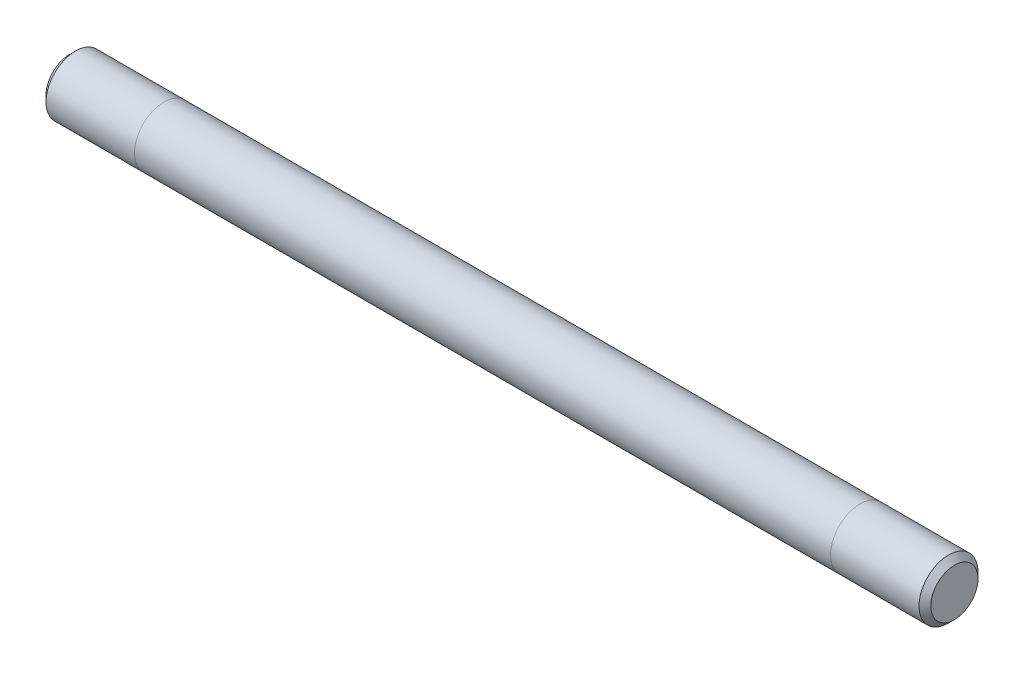
ISO-10303-21;
HEADER;
FILE_DESCRIPTION(('STEP AP214'),'2;1');
FILE_NAME('part.step','',(''),(''),'','','');
FILE_SCHEMA(('AUTOMOTIVE_DESIGN { 1 0 10303 214 1 1 1 1 }'));
ENDSEC;
DATA;
#1=APPLICATION_CONTEXT('core data for automotive mechanical design processes');
#2=APPLICATION_PROTOCOL_DEFINITION('international standard','automotive_design',2000,#1);
#3=PRODUCT_CONTEXT('',#1,'mechanical');
#4=PRODUCT('Part','Part','',(#3));
#5=PRODUCT_RELATED_PRODUCT_CATEGORY('part','',(#4));
#6=PRODUCT_DEFINITION_FORMATION('','',#4);
#7=PRODUCT_DEFINITION_CONTEXT('part definition',#1,'design');
#8=PRODUCT_DEFINITION('design','',#6,#7);
#9=PRODUCT_DEFINITION_SHAPE('','',#8);
#10=(LENGTH_UNIT() NAMED_UNIT(*) SI_UNIT(.MILLI.,.METRE.));
#11=(NAMED_UNIT(*) PLANE_ANGLE_UNIT() SI_UNIT($,.RADIAN.));
#12=(NAMED_UNIT(*) SI_UNIT($,.STERADIAN.) SOLID_ANGLE_UNIT());
#13=UNCERTAINTY_MEASURE_WITH_UNIT(LENGTH_MEASURE(1.E-05),#10,'distance_accuracy_value','');
#14=(GEOMETRIC_REPRESENTATION_CONTEXT(3) GLOBAL_UNCERTAINTY_ASSIGNED_CONTEXT((#13)) GLOBAL_UNIT_ASSIGNED_CONTEXT((#10,
#11,#12)) REPRESENTATION_CONTEXT('',''));
#15=CARTESIAN_POINT('',(0.,0.,0.));
#16=DIRECTION('',(0.,0.,1.));
#17=DIRECTION('',(1.,0.,0.));
#18=AXIS2_PLACEMENT_3D('',#15,#16,#17);
#19=CARTESIAN_POINT('',(75.,0.,0.));
#20=DIRECTION('',(-1.,0.,0.));
#21=DIRECTION('',(0.,0.,1.));
#22=AXIS2_PLACEMENT_3D('',#19,#20,#21);
#23=CYLINDRICAL_SURFACE('',#22,5.);
#24=CARTESIAN_POINT('',(74.,0.,0.));
#25=DIRECTION('',(1.,0.,0.));
#26=DIRECTION('',(0.,0.,-1.));
#27=AXIS2_PLACEMENT_3D('',#24,#25,#26);
#28=CIRCLE('',#27,5.);
#29=CARTESIAN_POINT('',(74.,0.,-5.));
#30=VERTEX_POINT('',#29);
#31=EDGE_CURVE('E49',#30,#30,#28,.F.);
#32=ORIENTED_EDGE('',*,*,#31,.T.);
#33=EDGE_LOOP('',(#32));
#34=FACE_BOUND('',#33,.T.);
#35=CARTESIAN_POINT('',(59.,0.,0.));
#36=DIRECTION('',(1.,0.,0.));
#37=DIRECTION('',(0.,0.,-1.));
#38=AXIS2_PLACEMENT_3D('',#35,#36,#37);
#39=CIRCLE('',#38,5.);
#40=CARTESIAN_POINT('',(59.,0.,-5.));
#41=VERTEX_POINT('',#40);
#42=EDGE_CURVE('E58',#41,#41,#39,.T.);
#43=ORIENTED_EDGE('',*,*,#42,.T.);
#44=EDGE_LOOP('',(#43));
#45=FACE_BOUND('',#44,.T.);
#46=ADVANCED_FACE('F38',(#34,#45),#23,.T.);
#47=CARTESIAN_POINT('',(-74.,0.,0.));
#48=DIRECTION('',(1.,0.,0.));
#49=DIRECTION('',(0.,0.,-1.));
#50=AXIS2_PLACEMENT_3D('',#47,#48,#49);
#51=CIRCLE('',#50,5.);
#52=CARTESIAN_POINT('',(-74.,0.,-5.));
#53=VERTEX_POINT('',#52);
#54=EDGE_CURVE('E45',#53,#53,#51,.T.);
#55=ORIENTED_EDGE('',*,*,#54,.T.);
#56=EDGE_LOOP('',(#55));
#57=FACE_BOUND('',#56,.T.);
#58=CARTESIAN_POINT('',(-59.,0.,0.));
#59=DIRECTION('',(-1.,0.,0.));
#60=DIRECTION('',(0.,0.,1.));
#61=AXIS2_PLACEMENT_3D('',#58,#59,#60);
#62=CIRCLE('',#61,5.);
#63=CARTESIAN_POINT('',(-59.,0.,5.));
#64=VERTEX_POINT('',#63);
#65=EDGE_CURVE('E61',#64,#64,#62,.T.);
#66=ORIENTED_EDGE('',*,*,#65,.T.);
#67=EDGE_LOOP('',(#66));
#68=FACE_BOUND('',#67,.T.);
#69=ADVANCED_FACE('F65',(#57,#68),#23,.T.);
#70=ORIENTED_EDGE('',*,*,#42,.F.);
#71=EDGE_LOOP('',(#70));
#72=FACE_BOUND('',#71,.T.);
#73=ORIENTED_EDGE('',*,*,#65,.F.);
#74=EDGE_LOOP('',(#73));
#75=FACE_BOUND('',#74,.T.);
#76=ADVANCED_FACE('F67',(#72,#75),#23,.T.);
#77=CARTESIAN_POINT('',(75.,0.,0.));
#78=DIRECTION('',(1.,0.,0.));
#79=DIRECTION('',(0.,0.,-1.));
#80=AXIS2_PLACEMENT_3D('',#77,#78,#79);
#81=PLANE('',#80);
#82=CARTESIAN_POINT('',(75.,0.,0.));
#83=DIRECTION('',(1.,0.,0.));
#84=DIRECTION('',(0.,0.,-1.));
#85=AXIS2_PLACEMENT_3D('',#82,#83,#84);
#86=CIRCLE('',#85,4.);
#87=CARTESIAN_POINT('',(75.,0.,-4.));
#88=VERTEX_POINT('',#87);
#89=EDGE_CURVE('E53',#88,#88,#86,.T.);
#90=ORIENTED_EDGE('',*,*,#89,.T.);
#91=EDGE_LOOP('',(#90));
#92=FACE_BOUND('',#91,.T.);
#93=ADVANCED_FACE('F69',(#92),#81,.T.);
#94=CARTESIAN_POINT('',(-75.,0.,0.));
#95=DIRECTION('',(1.,0.,0.));
#96=DIRECTION('',(0.,0.,-1.));
#97=AXIS2_PLACEMENT_3D('',#94,#95,#96);
#98=PLANE('',#97);
#99=CARTESIAN_POINT('',(-75.,0.,0.));
#100=DIRECTION('',(1.,0.,0.));
#101=DIRECTION('',(0.,0.,-1.));
#102=AXIS2_PLACEMENT_3D('',#99,#100,#101);
#103=CIRCLE('',#102,3.99999999999996);
#104=CARTESIAN_POINT('',(-75.,0.,-3.99999999999996));
#105=VERTEX_POINT('',#104);
#106=EDGE_CURVE('E11',#105,#105,#103,.F.);
#107=ORIENTED_EDGE('',*,*,#106,.T.);
#108=EDGE_LOOP('',(#107));
#109=FACE_BOUND('',#108,.T.);
#110=ADVANCED_FACE('F76',(#109),#98,.F.);
#111=CARTESIAN_POINT('',(75.,0.,0.));
#112=DIRECTION('',(-1.,0.,0.));
#113=DIRECTION('',(0.,0.,1.));
#114=AXIS2_PLACEMENT_3D('',#111,#112,#113);
#115=CONICAL_SURFACE('',#114,4.,0.785398163397446);
#116=ORIENTED_EDGE('',*,*,#31,.F.);
#117=EDGE_LOOP('',(#116));
#118=FACE_BOUND('',#117,.T.);
#119=ORIENTED_EDGE('',*,*,#89,.F.);
#120=EDGE_LOOP('',(#119));
#121=FACE_BOUND('',#120,.T.);
#122=ADVANCED_FACE('F88',(#118,#121),#115,.T.);
#123=CARTESIAN_POINT('',(-74.,0.,0.));
#124=DIRECTION('',(1.,0.,0.));
#125=DIRECTION('',(0.,0.,-1.));
#126=AXIS2_PLACEMENT_3D('',#123,#124,#125);
#127=CONICAL_SURFACE('',#126,5.,0.785398163397453);
#128=ORIENTED_EDGE('',*,*,#106,.F.);
#129=EDGE_LOOP('',(#128));
#130=FACE_BOUND('',#129,.T.);
#131=ORIENTED_EDGE('',*,*,#54,.F.);
#132=EDGE_LOOP('',(#131));
#133=FACE_BOUND('',#132,.T.);
#134=ADVANCED_FACE('F40',(#130,#133),#127,.T.);
#135=CLOSED_SHELL('',(#46,#69,#76,#93,#110,#122,#134));
#136=MANIFOLD_SOLID_BREP('B2',#135);
#137=ADVANCED_BREP_SHAPE_REPRESENTATION('',(#18,#136),#14);
#138=SHAPE_DEFINITION_REPRESENTATION(#9,#137);
ENDSEC;
END-ISO-10303-21;
